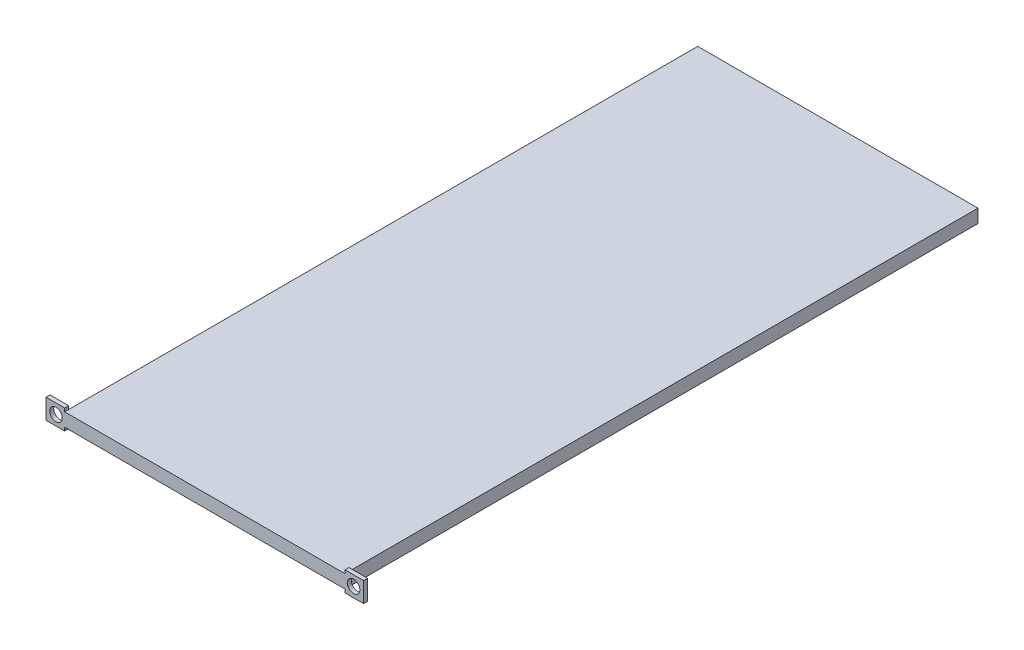
ISO-10303-21;
HEADER;
FILE_DESCRIPTION(('STEP AP214'),'2;1');
FILE_NAME('part.step','',(''),(''),'','','');
FILE_SCHEMA(('AUTOMOTIVE_DESIGN { 1 0 10303 214 1 1 1 1 }'));
ENDSEC;
DATA;
#1=APPLICATION_CONTEXT('core data for automotive mechanical design processes');
#2=APPLICATION_PROTOCOL_DEFINITION('international standard','automotive_design',2000,#1);
#3=PRODUCT_CONTEXT('',#1,'mechanical');
#4=PRODUCT('Part','Part','',(#3));
#5=PRODUCT_RELATED_PRODUCT_CATEGORY('part','',(#4));
#6=PRODUCT_DEFINITION_FORMATION('','',#4);
#7=PRODUCT_DEFINITION_CONTEXT('part definition',#1,'design');
#8=PRODUCT_DEFINITION('design','',#6,#7);
#9=PRODUCT_DEFINITION_SHAPE('','',#8);
#10=(LENGTH_UNIT() NAMED_UNIT(*) SI_UNIT(.MILLI.,.METRE.));
#11=(NAMED_UNIT(*) PLANE_ANGLE_UNIT() SI_UNIT($,.RADIAN.));
#12=(NAMED_UNIT(*) SI_UNIT($,.STERADIAN.) SOLID_ANGLE_UNIT());
#13=UNCERTAINTY_MEASURE_WITH_UNIT(LENGTH_MEASURE(1.E-05),#10,'distance_accuracy_value','');
#14=(GEOMETRIC_REPRESENTATION_CONTEXT(3) GLOBAL_UNCERTAINTY_ASSIGNED_CONTEXT((#13)) GLOBAL_UNIT_ASSIGNED_CONTEXT((#10,
#11,#12)) REPRESENTATION_CONTEXT('',''));
#15=CARTESIAN_POINT('',(0.,0.,0.));
#16=DIRECTION('',(0.,0.,1.));
#17=DIRECTION('',(1.,0.,0.));
#18=AXIS2_PLACEMENT_3D('',#15,#16,#17);
#19=CARTESIAN_POINT('',(210.29,0.,475.));
#20=DIRECTION('',(-1.,0.,0.));
#21=DIRECTION('',(0.,0.,1.));
#22=AXIS2_PLACEMENT_3D('',#19,#20,#21);
#23=PLANE('',#22);
#24=DIRECTION('',(0.,1.,0.));
#25=VECTOR('',#24,1.);
#26=CARTESIAN_POINT('',(210.29,12.5,472.));
#27=LINE('',#26,#25);
#28=CARTESIAN_POINT('',(210.29,0.,472.));
#29=VERTEX_POINT('',#28);
#30=CARTESIAN_POINT('',(210.29,10.,472.));
#31=VERTEX_POINT('',#30);
#32=EDGE_CURVE('E11',#29,#31,#27,.T.);
#33=ORIENTED_EDGE('',*,*,#32,.F.);
#34=DIRECTION('',(0.,0.,-1.));
#35=VECTOR('',#34,1.);
#36=CARTESIAN_POINT('',(210.29,0.,475.));
#37=LINE('',#36,#35);
#38=CARTESIAN_POINT('',(210.29,0.,0.));
#39=VERTEX_POINT('',#38);
#40=EDGE_CURVE('E228',#29,#39,#37,.T.);
#41=ORIENTED_EDGE('',*,*,#40,.T.);
#42=DIRECTION('',(0.,1.,0.));
#43=VECTOR('',#42,1.);
#44=CARTESIAN_POINT('',(210.29,0.,0.));
#45=LINE('',#44,#43);
#46=CARTESIAN_POINT('',(210.29,10.,0.));
#47=VERTEX_POINT('',#46);
#48=EDGE_CURVE('E218',#39,#47,#45,.T.);
#49=ORIENTED_EDGE('',*,*,#48,.T.);
#50=DIRECTION('',(0.,0.,-1.));
#51=VECTOR('',#50,1.);
#52=CARTESIAN_POINT('',(210.29,10.,475.));
#53=LINE('',#52,#51);
#54=EDGE_CURVE('E226',#31,#47,#53,.T.);
#55=ORIENTED_EDGE('',*,*,#54,.F.);
#56=EDGE_LOOP('',(#33,#41,#49,#55));
#57=FACE_BOUND('',#56,.T.);
#58=ADVANCED_FACE('F39',(#57),#23,.F.);
#59=CARTESIAN_POINT('',(0.,0.,475.));
#60=DIRECTION('',(1.,0.,0.));
#61=DIRECTION('',(0.,0.,-1.));
#62=AXIS2_PLACEMENT_3D('',#59,#60,#61);
#63=PLANE('',#62);
#64=DIRECTION('',(0.,-1.,0.));
#65=VECTOR('',#64,1.);
#66=CARTESIAN_POINT('',(0.,12.5,472.));
#67=LINE('',#66,#65);
#68=CARTESIAN_POINT('',(0.,10.,472.));
#69=VERTEX_POINT('',#68);
#70=CARTESIAN_POINT('',(0.,0.,472.));
#71=VERTEX_POINT('',#70);
#72=EDGE_CURVE('E48',#69,#71,#67,.T.);
#73=ORIENTED_EDGE('',*,*,#72,.F.);
#74=DIRECTION('',(0.,0.,-1.));
#75=VECTOR('',#74,1.);
#76=CARTESIAN_POINT('',(0.,10.,475.));
#77=LINE('',#76,#75);
#78=CARTESIAN_POINT('',(0.,10.,0.));
#79=VERTEX_POINT('',#78);
#80=EDGE_CURVE('E212',#69,#79,#77,.T.);
#81=ORIENTED_EDGE('',*,*,#80,.T.);
#82=DIRECTION('',(0.,-1.,0.));
#83=VECTOR('',#82,1.);
#84=CARTESIAN_POINT('',(0.,0.,0.));
#85=LINE('',#84,#83);
#86=CARTESIAN_POINT('',(0.,0.,0.));
#87=VERTEX_POINT('',#86);
#88=EDGE_CURVE('E206',#79,#87,#85,.T.);
#89=ORIENTED_EDGE('',*,*,#88,.T.);
#90=DIRECTION('',(0.,0.,-1.));
#91=VECTOR('',#90,1.);
#92=CARTESIAN_POINT('',(0.,0.,475.));
#93=LINE('',#92,#91);
#94=EDGE_CURVE('E231',#71,#87,#93,.T.);
#95=ORIENTED_EDGE('',*,*,#94,.F.);
#96=EDGE_LOOP('',(#73,#81,#89,#95));
#97=FACE_BOUND('',#96,.T.);
#98=ADVANCED_FACE('F41',(#97),#63,.F.);
#99=CARTESIAN_POINT('',(0.,0.,475.));
#100=DIRECTION('',(0.,1.,0.));
#101=DIRECTION('',(0.,0.,1.));
#102=AXIS2_PLACEMENT_3D('',#99,#100,#101);
#103=PLANE('',#102);
#104=DIRECTION('',(1.,0.,0.));
#105=VECTOR('',#104,1.);
#106=CARTESIAN_POINT('',(0.,0.,0.));
#107=LINE('',#106,#105);
#108=EDGE_CURVE('E215',#87,#39,#107,.T.);
#109=ORIENTED_EDGE('',*,*,#108,.T.);
#110=ORIENTED_EDGE('',*,*,#40,.F.);
#111=CARTESIAN_POINT('',(210.29,0.,475.));
#112=VERTEX_POINT('',#111);
#113=EDGE_CURVE('E229',#112,#29,#37,.T.);
#114=ORIENTED_EDGE('',*,*,#113,.F.);
#115=DIRECTION('',(1.,0.,0.));
#116=VECTOR('',#115,1.);
#117=CARTESIAN_POINT('',(0.,0.,475.));
#118=LINE('',#117,#116);
#119=CARTESIAN_POINT('',(0.,0.,475.));
#120=VERTEX_POINT('',#119);
#121=EDGE_CURVE('E207',#120,#112,#118,.T.);
#122=ORIENTED_EDGE('',*,*,#121,.F.);
#123=EDGE_CURVE('E43',#120,#71,#93,.T.);
#124=ORIENTED_EDGE('',*,*,#123,.T.);
#125=ORIENTED_EDGE('',*,*,#94,.T.);
#126=EDGE_LOOP('',(#109,#110,#114,#122,#124,#125));
#127=FACE_BOUND('',#126,.T.);
#128=ADVANCED_FACE('F240',(#127),#103,.F.);
#129=CARTESIAN_POINT('',(0.,10.,475.));
#130=DIRECTION('',(0.,-1.,0.));
#131=DIRECTION('',(0.,0.,-1.));
#132=AXIS2_PLACEMENT_3D('',#129,#130,#131);
#133=PLANE('',#132);
#134=DIRECTION('',(-1.,0.,0.));
#135=VECTOR('',#134,1.);
#136=CARTESIAN_POINT('',(0.,10.,0.));
#137=LINE('',#136,#135);
#138=EDGE_CURVE('E210',#47,#79,#137,.T.);
#139=ORIENTED_EDGE('',*,*,#138,.T.);
#140=ORIENTED_EDGE('',*,*,#80,.F.);
#141=CARTESIAN_POINT('',(0.,10.,475.));
#142=VERTEX_POINT('',#141);
#143=EDGE_CURVE('E223',#142,#69,#77,.T.);
#144=ORIENTED_EDGE('',*,*,#143,.F.);
#145=DIRECTION('',(-1.,0.,0.));
#146=VECTOR('',#145,1.);
#147=CARTESIAN_POINT('',(0.,10.,475.));
#148=LINE('',#147,#146);
#149=CARTESIAN_POINT('',(210.29,10.,475.));
#150=VERTEX_POINT('',#149);
#151=EDGE_CURVE('E209',#150,#142,#148,.T.);
#152=ORIENTED_EDGE('',*,*,#151,.F.);
#153=EDGE_CURVE('E227',#150,#31,#53,.T.);
#154=ORIENTED_EDGE('',*,*,#153,.T.);
#155=ORIENTED_EDGE('',*,*,#54,.T.);
#156=EDGE_LOOP('',(#139,#140,#144,#152,#154,#155));
#157=FACE_BOUND('',#156,.T.);
#158=ADVANCED_FACE('F245',(#157),#133,.F.);
#159=CARTESIAN_POINT('',(0.,0.,475.));
#160=DIRECTION('',(0.,0.,-1.));
#161=DIRECTION('',(-1.,0.,0.));
#162=AXIS2_PLACEMENT_3D('',#159,#160,#161);
#163=PLANE('',#162);
#164=CARTESIAN_POINT('',(-6.5,5.,475.));
#165=DIRECTION('',(0.,0.,-1.));
#166=DIRECTION('',(-1.,0.,0.));
#167=AXIS2_PLACEMENT_3D('',#164,#165,#166);
#168=CIRCLE('',#167,4.7);
#169=CARTESIAN_POINT('',(-11.2,5.,475.));
#170=VERTEX_POINT('',#169);
#171=EDGE_CURVE('E269',#170,#170,#168,.T.);
#172=ORIENTED_EDGE('',*,*,#171,.T.);
#173=EDGE_LOOP('',(#172));
#174=FACE_BOUND('',#173,.T.);
#175=CARTESIAN_POINT('',(216.79,5.00000000000003,475.));
#176=DIRECTION('',(0.,0.,-1.));
#177=DIRECTION('',(-1.,0.,0.));
#178=AXIS2_PLACEMENT_3D('',#175,#176,#177);
#179=CIRCLE('',#178,4.69999999999998);
#180=CARTESIAN_POINT('',(212.09,5.00000000000003,475.));
#181=VERTEX_POINT('',#180);
#182=EDGE_CURVE('E271',#181,#181,#179,.T.);
#183=ORIENTED_EDGE('',*,*,#182,.T.);
#184=EDGE_LOOP('',(#183));
#185=FACE_BOUND('',#184,.T.);
#186=ORIENTED_EDGE('',*,*,#151,.T.);
#187=DIRECTION('',(0.,1.,0.));
#188=VECTOR('',#187,1.);
#189=CARTESIAN_POINT('',(0.,12.5,475.));
#190=LINE('',#189,#188);
#191=CARTESIAN_POINT('',(0.,12.5,475.));
#192=VERTEX_POINT('',#191);
#193=EDGE_CURVE('E168',#142,#192,#190,.T.);
#194=ORIENTED_EDGE('',*,*,#193,.T.);
#195=DIRECTION('',(1.,0.,0.));
#196=VECTOR('',#195,1.);
#197=CARTESIAN_POINT('',(-14.,12.5,475.));
#198=LINE('',#197,#196);
#199=CARTESIAN_POINT('',(-14.,12.5,475.));
#200=VERTEX_POINT('',#199);
#201=EDGE_CURVE('E203',#200,#192,#198,.T.);
#202=ORIENTED_EDGE('',*,*,#201,.F.);
#203=DIRECTION('',(0.,1.,0.));
#204=VECTOR('',#203,1.);
#205=CARTESIAN_POINT('',(-14.,12.5,475.));
#206=LINE('',#205,#204);
#207=CARTESIAN_POINT('',(-14.,-2.5,475.));
#208=VERTEX_POINT('',#207);
#209=EDGE_CURVE('E176',#208,#200,#206,.T.);
#210=ORIENTED_EDGE('',*,*,#209,.F.);
#211=DIRECTION('',(1.,0.,0.));
#212=VECTOR('',#211,1.);
#213=CARTESIAN_POINT('',(-14.,-2.5,475.));
#214=LINE('',#213,#212);
#215=CARTESIAN_POINT('',(0.,-2.5,475.));
#216=VERTEX_POINT('',#215);
#217=EDGE_CURVE('E185',#208,#216,#214,.T.);
#218=ORIENTED_EDGE('',*,*,#217,.T.);
#219=EDGE_CURVE('E170',#216,#120,#190,.T.);
#220=ORIENTED_EDGE('',*,*,#219,.T.);
#221=ORIENTED_EDGE('',*,*,#121,.T.);
#222=DIRECTION('',(0.,-1.,0.));
#223=VECTOR('',#222,1.);
#224=CARTESIAN_POINT('',(210.29,12.5,475.));
#225=LINE('',#224,#223);
#226=CARTESIAN_POINT('',(210.29,-2.5,475.));
#227=VERTEX_POINT('',#226);
#228=EDGE_CURVE('E166',#112,#227,#225,.T.);
#229=ORIENTED_EDGE('',*,*,#228,.T.);
#230=DIRECTION('',(-1.,0.,0.));
#231=VECTOR('',#230,1.);
#232=CARTESIAN_POINT('',(224.29,-2.5,475.));
#233=LINE('',#232,#231);
#234=CARTESIAN_POINT('',(224.29,-2.5,475.));
#235=VERTEX_POINT('',#234);
#236=EDGE_CURVE('E147',#235,#227,#233,.T.);
#237=ORIENTED_EDGE('',*,*,#236,.F.);
#238=DIRECTION('',(0.,-1.,0.));
#239=VECTOR('',#238,1.);
#240=CARTESIAN_POINT('',(224.29,12.5,475.));
#241=LINE('',#240,#239);
#242=CARTESIAN_POINT('',(224.29,12.5,475.));
#243=VERTEX_POINT('',#242);
#244=EDGE_CURVE('E153',#243,#235,#241,.T.);
#245=ORIENTED_EDGE('',*,*,#244,.F.);
#246=DIRECTION('',(-1.,0.,0.));
#247=VECTOR('',#246,1.);
#248=CARTESIAN_POINT('',(224.29,12.5,475.));
#249=LINE('',#248,#247);
#250=CARTESIAN_POINT('',(210.29,12.5,475.));
#251=VERTEX_POINT('',#250);
#252=EDGE_CURVE('E263',#243,#251,#249,.T.);
#253=ORIENTED_EDGE('',*,*,#252,.T.);
#254=EDGE_CURVE('E268',#251,#150,#225,.T.);
#255=ORIENTED_EDGE('',*,*,#254,.T.);
#256=EDGE_LOOP('',(#186,#194,#202,#210,#218,#220,#221,#229,#237,#245,#253,#255));
#257=FACE_BOUND('',#256,.T.);
#258=ADVANCED_FACE('F164',(#174,#185,#257),#163,.F.);
#259=CARTESIAN_POINT('',(0.,0.,0.));
#260=DIRECTION('',(0.,0.,-1.));
#261=DIRECTION('',(-1.,0.,0.));
#262=AXIS2_PLACEMENT_3D('',#259,#260,#261);
#263=PLANE('',#262);
#264=ORIENTED_EDGE('',*,*,#88,.F.);
#265=ORIENTED_EDGE('',*,*,#138,.F.);
#266=ORIENTED_EDGE('',*,*,#48,.F.);
#267=ORIENTED_EDGE('',*,*,#108,.F.);
#268=EDGE_LOOP('',(#264,#265,#266,#267));
#269=FACE_BOUND('',#268,.T.);
#270=ADVANCED_FACE('F243',(#269),#263,.T.);
#271=CARTESIAN_POINT('',(0.,0.,0.));
#272=DIRECTION('',(1.,0.,0.));
#273=DIRECTION('',(0.,0.,-1.));
#274=AXIS2_PLACEMENT_3D('',#271,#272,#273);
#275=PLANE('',#274);
#276=ORIENTED_EDGE('',*,*,#123,.F.);
#277=ORIENTED_EDGE('',*,*,#219,.F.);
#278=DIRECTION('',(0.,0.,1.));
#279=VECTOR('',#278,1.);
#280=CARTESIAN_POINT('',(0.,-2.5,475.));
#281=LINE('',#280,#279);
#282=CARTESIAN_POINT('',(0.,-2.5,472.));
#283=VERTEX_POINT('',#282);
#284=EDGE_CURVE('E180',#283,#216,#281,.T.);
#285=ORIENTED_EDGE('',*,*,#284,.F.);
#286=EDGE_CURVE('E190',#71,#283,#67,.T.);
#287=ORIENTED_EDGE('',*,*,#286,.F.);
#288=EDGE_LOOP('',(#276,#277,#285,#287));
#289=FACE_BOUND('',#288,.T.);
#290=ADVANCED_FACE('F314',(#289),#275,.T.);
#291=CARTESIAN_POINT('',(-14.,12.5,475.));
#292=DIRECTION('',(0.,-1.,0.));
#293=DIRECTION('',(0.,0.,-1.));
#294=AXIS2_PLACEMENT_3D('',#291,#292,#293);
#295=PLANE('',#294);
#296=DIRECTION('',(0.,0.,-1.));
#297=VECTOR('',#296,1.);
#298=CARTESIAN_POINT('',(0.,12.5,475.));
#299=LINE('',#298,#297);
#300=CARTESIAN_POINT('',(0.,12.5,472.));
#301=VERTEX_POINT('',#300);
#302=EDGE_CURVE('E188',#192,#301,#299,.T.);
#303=ORIENTED_EDGE('',*,*,#302,.T.);
#304=DIRECTION('',(1.,0.,0.));
#305=VECTOR('',#304,1.);
#306=CARTESIAN_POINT('',(-14.,12.5,472.));
#307=LINE('',#306,#305);
#308=CARTESIAN_POINT('',(-14.,12.5,472.));
#309=VERTEX_POINT('',#308);
#310=EDGE_CURVE('E200',#309,#301,#307,.T.);
#311=ORIENTED_EDGE('',*,*,#310,.F.);
#312=DIRECTION('',(0.,0.,-1.));
#313=VECTOR('',#312,1.);
#314=CARTESIAN_POINT('',(-14.,12.5,475.));
#315=LINE('',#314,#313);
#316=EDGE_CURVE('E179',#200,#309,#315,.T.);
#317=ORIENTED_EDGE('',*,*,#316,.F.);
#318=ORIENTED_EDGE('',*,*,#201,.T.);
#319=EDGE_LOOP('',(#303,#311,#317,#318));
#320=FACE_BOUND('',#319,.T.);
#321=ADVANCED_FACE('F292',(#320),#295,.F.);
#322=CARTESIAN_POINT('',(-14.,12.5,472.));
#323=DIRECTION('',(0.,0.,1.));
#324=DIRECTION('',(1.,0.,0.));
#325=AXIS2_PLACEMENT_3D('',#322,#323,#324);
#326=PLANE('',#325);
#327=CARTESIAN_POINT('',(-6.5,5.,472.));
#328=DIRECTION('',(0.,0.,-1.));
#329=DIRECTION('',(-1.,0.,0.));
#330=AXIS2_PLACEMENT_3D('',#327,#328,#329);
#331=CIRCLE('',#330,4.7);
#332=CARTESIAN_POINT('',(-11.2,5.,472.));
#333=VERTEX_POINT('',#332);
#334=EDGE_CURVE('E276',#333,#333,#331,.T.);
#335=ORIENTED_EDGE('',*,*,#334,.F.);
#336=EDGE_LOOP('',(#335));
#337=FACE_BOUND('',#336,.T.);
#338=EDGE_CURVE('E191',#301,#69,#67,.T.);
#339=ORIENTED_EDGE('',*,*,#338,.T.);
#340=ORIENTED_EDGE('',*,*,#72,.T.);
#341=ORIENTED_EDGE('',*,*,#286,.T.);
#342=DIRECTION('',(1.,0.,0.));
#343=VECTOR('',#342,1.);
#344=CARTESIAN_POINT('',(-14.,-2.5,472.));
#345=LINE('',#344,#343);
#346=CARTESIAN_POINT('',(-14.,-2.5,472.));
#347=VERTEX_POINT('',#346);
#348=EDGE_CURVE('E197',#347,#283,#345,.T.);
#349=ORIENTED_EDGE('',*,*,#348,.F.);
#350=DIRECTION('',(0.,-1.,0.));
#351=VECTOR('',#350,1.);
#352=CARTESIAN_POINT('',(-14.,12.5,472.));
#353=LINE('',#352,#351);
#354=EDGE_CURVE('E182',#309,#347,#353,.T.);
#355=ORIENTED_EDGE('',*,*,#354,.F.);
#356=ORIENTED_EDGE('',*,*,#310,.T.);
#357=EDGE_LOOP('',(#339,#340,#341,#349,#355,#356));
#358=FACE_BOUND('',#357,.T.);
#359=ADVANCED_FACE('F288',(#337,#358),#326,.F.);
#360=CARTESIAN_POINT('',(-14.,-2.5,475.));
#361=DIRECTION('',(0.,1.,0.));
#362=DIRECTION('',(0.,0.,1.));
#363=AXIS2_PLACEMENT_3D('',#360,#361,#362);
#364=PLANE('',#363);
#365=ORIENTED_EDGE('',*,*,#284,.T.);
#366=ORIENTED_EDGE('',*,*,#217,.F.);
#367=DIRECTION('',(0.,0.,1.));
#368=VECTOR('',#367,1.);
#369=CARTESIAN_POINT('',(-14.,-2.5,475.));
#370=LINE('',#369,#368);
#371=EDGE_CURVE('E184',#347,#208,#370,.T.);
#372=ORIENTED_EDGE('',*,*,#371,.F.);
#373=ORIENTED_EDGE('',*,*,#348,.T.);
#374=EDGE_LOOP('',(#365,#366,#372,#373));
#375=FACE_BOUND('',#374,.T.);
#376=ADVANCED_FACE('F291',(#375),#364,.F.);
#377=CARTESIAN_POINT('',(-14.,0.,0.));
#378=DIRECTION('',(1.,0.,0.));
#379=DIRECTION('',(0.,0.,-1.));
#380=AXIS2_PLACEMENT_3D('',#377,#378,#379);
#381=PLANE('',#380);
#382=ORIENTED_EDGE('',*,*,#209,.T.);
#383=ORIENTED_EDGE('',*,*,#316,.T.);
#384=ORIENTED_EDGE('',*,*,#354,.T.);
#385=ORIENTED_EDGE('',*,*,#371,.T.);
#386=EDGE_LOOP('',(#382,#383,#384,#385));
#387=FACE_BOUND('',#386,.T.);
#388=ADVANCED_FACE('F305',(#387),#381,.F.);
#389=ORIENTED_EDGE('',*,*,#193,.F.);
#390=ORIENTED_EDGE('',*,*,#143,.T.);
#391=ORIENTED_EDGE('',*,*,#338,.F.);
#392=ORIENTED_EDGE('',*,*,#302,.F.);
#393=EDGE_LOOP('',(#389,#390,#391,#392));
#394=FACE_BOUND('',#393,.T.);
#395=ADVANCED_FACE('F300',(#394),#275,.T.);
#396=CARTESIAN_POINT('',(210.29,0.,0.));
#397=DIRECTION('',(1.,0.,0.));
#398=DIRECTION('',(0.,0.,-1.));
#399=AXIS2_PLACEMENT_3D('',#396,#397,#398);
#400=PLANE('',#399);
#401=ORIENTED_EDGE('',*,*,#228,.F.);
#402=ORIENTED_EDGE('',*,*,#113,.T.);
#403=CARTESIAN_POINT('',(210.29,-2.5,472.));
#404=VERTEX_POINT('',#403);
#405=EDGE_CURVE('E50',#404,#29,#27,.T.);
#406=ORIENTED_EDGE('',*,*,#405,.F.);
#407=DIRECTION('',(0.,0.,-1.));
#408=VECTOR('',#407,1.);
#409=CARTESIAN_POINT('',(210.29,-2.5,475.));
#410=LINE('',#409,#408);
#411=EDGE_CURVE('E257',#227,#404,#410,.T.);
#412=ORIENTED_EDGE('',*,*,#411,.F.);
#413=EDGE_LOOP('',(#401,#402,#406,#412));
#414=FACE_BOUND('',#413,.T.);
#415=ADVANCED_FACE('F337',(#414),#400,.F.);
#416=CARTESIAN_POINT('',(224.29,-2.5,475.));
#417=DIRECTION('',(0.,1.,0.));
#418=DIRECTION('',(0.,0.,1.));
#419=AXIS2_PLACEMENT_3D('',#416,#417,#418);
#420=PLANE('',#419);
#421=ORIENTED_EDGE('',*,*,#411,.T.);
#422=DIRECTION('',(-1.,0.,0.));
#423=VECTOR('',#422,1.);
#424=CARTESIAN_POINT('',(224.29,-2.5,472.));
#425=LINE('',#424,#423);
#426=CARTESIAN_POINT('',(224.29,-2.5,472.));
#427=VERTEX_POINT('',#426);
#428=EDGE_CURVE('E149',#427,#404,#425,.T.);
#429=ORIENTED_EDGE('',*,*,#428,.F.);
#430=DIRECTION('',(0.,0.,-1.));
#431=VECTOR('',#430,1.);
#432=CARTESIAN_POINT('',(224.29,-2.5,475.));
#433=LINE('',#432,#431);
#434=EDGE_CURVE('E143',#235,#427,#433,.T.);
#435=ORIENTED_EDGE('',*,*,#434,.F.);
#436=ORIENTED_EDGE('',*,*,#236,.T.);
#437=EDGE_LOOP('',(#421,#429,#435,#436));
#438=FACE_BOUND('',#437,.T.);
#439=ADVANCED_FACE('F145',(#438),#420,.F.);
#440=CARTESIAN_POINT('',(224.29,12.5,472.));
#441=DIRECTION('',(0.,0.,1.));
#442=DIRECTION('',(1.,0.,0.));
#443=AXIS2_PLACEMENT_3D('',#440,#441,#442);
#444=PLANE('',#443);
#445=CARTESIAN_POINT('',(216.79,5.00000000000003,472.));
#446=DIRECTION('',(0.,0.,-1.));
#447=DIRECTION('',(1.,0.,0.));
#448=AXIS2_PLACEMENT_3D('',#445,#446,#447);
#449=CIRCLE('',#448,4.69999999999998);
#450=CARTESIAN_POINT('',(221.49,5.00000000000003,472.));
#451=VERTEX_POINT('',#450);
#452=EDGE_CURVE('E279',#451,#451,#449,.T.);
#453=ORIENTED_EDGE('',*,*,#452,.F.);
#454=EDGE_LOOP('',(#453));
#455=FACE_BOUND('',#454,.T.);
#456=ORIENTED_EDGE('',*,*,#405,.T.);
#457=ORIENTED_EDGE('',*,*,#32,.T.);
#458=CARTESIAN_POINT('',(210.29,12.5,472.));
#459=VERTEX_POINT('',#458);
#460=EDGE_CURVE('E51',#31,#459,#27,.T.);
#461=ORIENTED_EDGE('',*,*,#460,.T.);
#462=DIRECTION('',(-1.,0.,0.));
#463=VECTOR('',#462,1.);
#464=CARTESIAN_POINT('',(224.29,12.5,472.));
#465=LINE('',#464,#463);
#466=CARTESIAN_POINT('',(224.29,12.5,472.));
#467=VERTEX_POINT('',#466);
#468=EDGE_CURVE('E172',#467,#459,#465,.T.);
#469=ORIENTED_EDGE('',*,*,#468,.F.);
#470=DIRECTION('',(0.,1.,0.));
#471=VECTOR('',#470,1.);
#472=CARTESIAN_POINT('',(224.29,12.5,472.));
#473=LINE('',#472,#471);
#474=EDGE_CURVE('E152',#427,#467,#473,.T.);
#475=ORIENTED_EDGE('',*,*,#474,.F.);
#476=ORIENTED_EDGE('',*,*,#428,.T.);
#477=EDGE_LOOP('',(#456,#457,#461,#469,#475,#476));
#478=FACE_BOUND('',#477,.T.);
#479=ADVANCED_FACE('F258',(#455,#478),#444,.F.);
#480=CARTESIAN_POINT('',(224.29,12.5,475.));
#481=DIRECTION('',(0.,-1.,0.));
#482=DIRECTION('',(0.,0.,-1.));
#483=AXIS2_PLACEMENT_3D('',#480,#481,#482);
#484=PLANE('',#483);
#485=DIRECTION('',(0.,0.,1.));
#486=VECTOR('',#485,1.);
#487=CARTESIAN_POINT('',(210.29,12.5,475.));
#488=LINE('',#487,#486);
#489=EDGE_CURVE('E162',#459,#251,#488,.T.);
#490=ORIENTED_EDGE('',*,*,#489,.T.);
#491=ORIENTED_EDGE('',*,*,#252,.F.);
#492=DIRECTION('',(0.,0.,1.));
#493=VECTOR('',#492,1.);
#494=CARTESIAN_POINT('',(224.29,12.5,475.));
#495=LINE('',#494,#493);
#496=EDGE_CURVE('E158',#467,#243,#495,.T.);
#497=ORIENTED_EDGE('',*,*,#496,.F.);
#498=ORIENTED_EDGE('',*,*,#468,.T.);
#499=EDGE_LOOP('',(#490,#491,#497,#498));
#500=FACE_BOUND('',#499,.T.);
#501=ADVANCED_FACE('F265',(#500),#484,.F.);
#502=CARTESIAN_POINT('',(224.29,0.,0.));
#503=DIRECTION('',(1.,0.,0.));
#504=DIRECTION('',(0.,0.,-1.));
#505=AXIS2_PLACEMENT_3D('',#502,#503,#504);
#506=PLANE('',#505);
#507=ORIENTED_EDGE('',*,*,#244,.T.);
#508=ORIENTED_EDGE('',*,*,#434,.T.);
#509=ORIENTED_EDGE('',*,*,#474,.T.);
#510=ORIENTED_EDGE('',*,*,#496,.T.);
#511=EDGE_LOOP('',(#507,#508,#509,#510));
#512=FACE_BOUND('',#511,.T.);
#513=ADVANCED_FACE('F156',(#512),#506,.T.);
#514=ORIENTED_EDGE('',*,*,#153,.F.);
#515=ORIENTED_EDGE('',*,*,#254,.F.);
#516=ORIENTED_EDGE('',*,*,#489,.F.);
#517=ORIENTED_EDGE('',*,*,#460,.F.);
#518=EDGE_LOOP('',(#514,#515,#516,#517));
#519=FACE_BOUND('',#518,.T.);
#520=ADVANCED_FACE('F251',(#519),#400,.F.);
#521=CARTESIAN_POINT('',(216.79,5.00000000000003,485.));
#522=DIRECTION('',(0.,0.,-1.));
#523=DIRECTION('',(-1.,0.,0.));
#524=AXIS2_PLACEMENT_3D('',#521,#522,#523);
#525=CYLINDRICAL_SURFACE('',#524,4.69999999999998);
#526=ORIENTED_EDGE('',*,*,#452,.T.);
#527=EDGE_LOOP('',(#526));
#528=FACE_BOUND('',#527,.T.);
#529=ORIENTED_EDGE('',*,*,#182,.F.);
#530=EDGE_LOOP('',(#529));
#531=FACE_BOUND('',#530,.T.);
#532=ADVANCED_FACE('F349',(#528,#531),#525,.F.);
#533=CARTESIAN_POINT('',(-6.5,5.,485.));
#534=DIRECTION('',(0.,0.,-1.));
#535=DIRECTION('',(-1.,0.,0.));
#536=AXIS2_PLACEMENT_3D('',#533,#534,#535);
#537=CYLINDRICAL_SURFACE('',#536,4.7);
#538=ORIENTED_EDGE('',*,*,#334,.T.);
#539=EDGE_LOOP('',(#538));
#540=FACE_BOUND('',#539,.T.);
#541=ORIENTED_EDGE('',*,*,#171,.F.);
#542=EDGE_LOOP('',(#541));
#543=FACE_BOUND('',#542,.T.);
#544=ADVANCED_FACE('F285',(#540,#543),#537,.F.);
#545=CLOSED_SHELL('',(#58,#98,#128,#158,#258,#270,#290,#321,#359,#376,#388,#395,#415,#439,#479,
#501,#513,#520,#532,#544));
#546=MANIFOLD_SOLID_BREP('B2',#545);
#547=ADVANCED_BREP_SHAPE_REPRESENTATION('',(#18,#546),#14);
#548=SHAPE_DEFINITION_REPRESENTATION(#9,#547);
ENDSEC;
END-ISO-10303-21;
